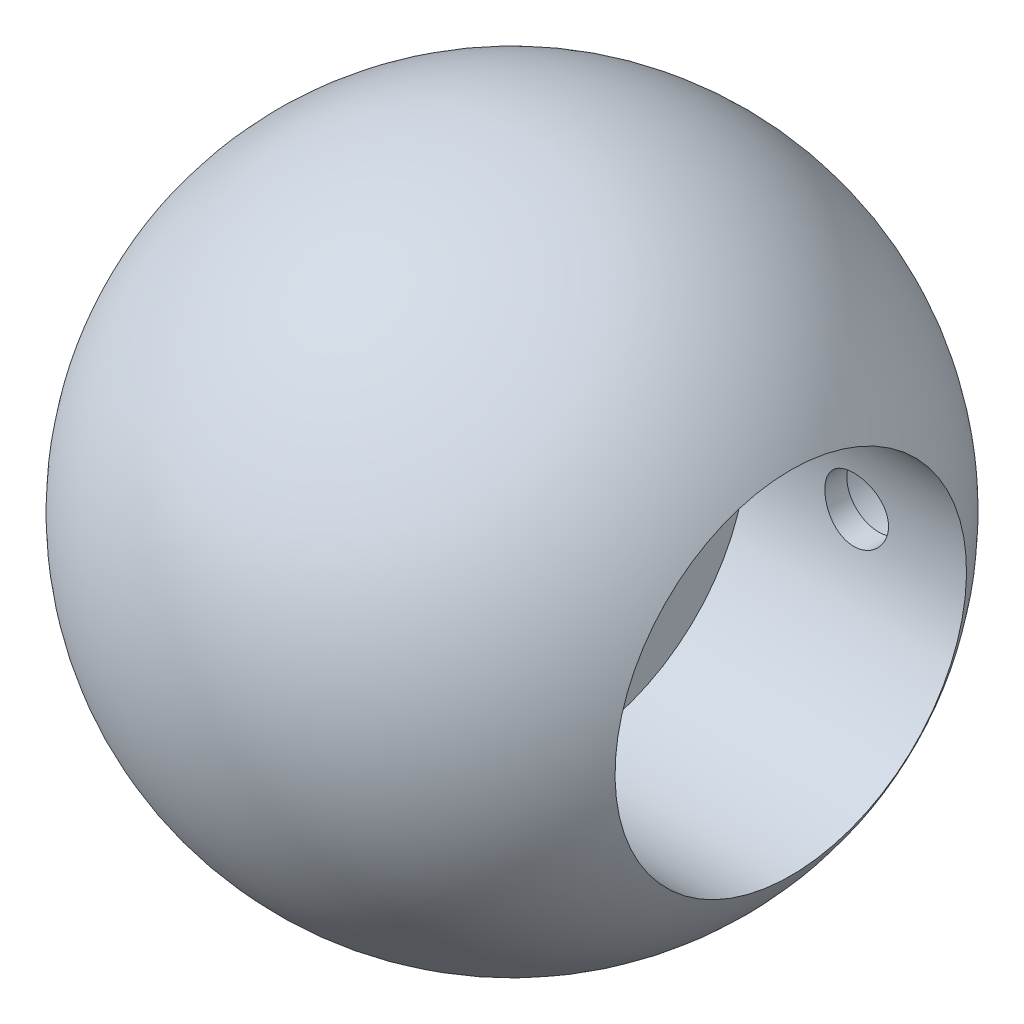
ISO-10303-21;
HEADER;
FILE_DESCRIPTION(('STEP AP214'),'2;1');
FILE_NAME('part.step','',(''),(''),'','','');
FILE_SCHEMA(('AUTOMOTIVE_DESIGN { 1 0 10303 214 1 1 1 1 }'));
ENDSEC;
DATA;
#1=APPLICATION_CONTEXT('core data for automotive mechanical design processes');
#2=APPLICATION_PROTOCOL_DEFINITION('international standard','automotive_design',2000,#1);
#3=PRODUCT_CONTEXT('',#1,'mechanical');
#4=PRODUCT('Part','Part','',(#3));
#5=PRODUCT_RELATED_PRODUCT_CATEGORY('part','',(#4));
#6=PRODUCT_DEFINITION_FORMATION('','',#4);
#7=PRODUCT_DEFINITION_CONTEXT('part definition',#1,'design');
#8=PRODUCT_DEFINITION('design','',#6,#7);
#9=PRODUCT_DEFINITION_SHAPE('','',#8);
#10=(LENGTH_UNIT() NAMED_UNIT(*) SI_UNIT(.MILLI.,.METRE.));
#11=(NAMED_UNIT(*) PLANE_ANGLE_UNIT() SI_UNIT($,.RADIAN.));
#12=(NAMED_UNIT(*) SI_UNIT($,.STERADIAN.) SOLID_ANGLE_UNIT());
#13=UNCERTAINTY_MEASURE_WITH_UNIT(LENGTH_MEASURE(1.E-05),#10,'distance_accuracy_value','');
#14=(GEOMETRIC_REPRESENTATION_CONTEXT(3) GLOBAL_UNCERTAINTY_ASSIGNED_CONTEXT((#13)) GLOBAL_UNIT_ASSIGNED_CONTEXT((#10,
#11,#12)) REPRESENTATION_CONTEXT('',''));
#15=CARTESIAN_POINT('',(0.,0.,0.));
#16=DIRECTION('',(0.,0.,1.));
#17=DIRECTION('',(1.,0.,0.));
#18=AXIS2_PLACEMENT_3D('',#15,#16,#17);
#19=CARTESIAN_POINT('',(2.68857754044952,0.,0.));
#20=DIRECTION('',(1.,0.,0.));
#21=DIRECTION('',(0.,1.,0.));
#22=AXIS2_PLACEMENT_3D('',#19,#20,#21);
#23=CYLINDRICAL_SURFACE('',#22,8.);
#24=CARTESIAN_POINT('',(2.68857754044952,0.,0.));
#25=DIRECTION('',(1.,0.,0.));
#26=DIRECTION('',(0.,1.,0.));
#27=AXIS2_PLACEMENT_3D('',#24,#25,#26);
#28=CIRCLE('',#27,8.);
#29=CARTESIAN_POINT('',(2.68857754044952,8.,0.));
#30=VERTEX_POINT('',#29);
#31=EDGE_CURVE('E10',#30,#30,#28,.T.);
#32=ORIENTED_EDGE('',*,*,#31,.F.);
#33=EDGE_LOOP('',(#32));
#34=FACE_BOUND('',#33,.T.);
#35=CARTESIAN_POINT('',(12.6885775404495,0.,0.));
#36=DIRECTION('',(1.,0.,0.));
#37=DIRECTION('',(0.,1.,0.));
#38=AXIS2_PLACEMENT_3D('',#35,#36,#37);
#39=CIRCLE('',#38,8.);
#40=CARTESIAN_POINT('',(12.6885775404495,8.,0.));
#41=VERTEX_POINT('',#40);
#42=EDGE_CURVE('E50',#41,#41,#39,.T.);
#43=ORIENTED_EDGE('',*,*,#42,.T.);
#44=EDGE_LOOP('',(#43));
#45=FACE_BOUND('',#44,.T.);
#46=CARTESIAN_POINT('',(6.23857754044952,0.,-8.));
#47=CARTESIAN_POINT('',(6.2385806760552,-0.0807384168234218,-7.99999855711492));
#48=CARTESIAN_POINT('',(6.2453438010963,-0.161518203029463,-7.99876509049859));
#49=CARTESIAN_POINT('',(6.27220211897829,-0.320804782772892,-7.9939633998169));
#50=CARTESIAN_POINT('',(6.29230887818976,-0.399309542630493,-7.99039315024603));
#51=CARTESIAN_POINT('',(6.34522131851264,-0.551719111767319,-7.98131760656954));
#52=CARTESIAN_POINT('',(6.37801586589205,-0.625627888274455,-7.97581400939515));
#53=CARTESIAN_POINT('',(6.45534210489281,-0.766886478728498,-7.96347404674392));
#54=CARTESIAN_POINT('',(6.49987272513365,-0.83423689061719,-7.9566378029386));
#55=CARTESIAN_POINT('',(6.59993798264261,-0.961230528069859,-7.94230232780297));
#56=CARTESIAN_POINT('',(6.65557873062222,-1.02078947767733,-7.93479712298762));
#57=CARTESIAN_POINT('',(6.77605649344991,-1.12978079245367,-7.92001437127186));
#58=CARTESIAN_POINT('',(6.8408941424298,-1.17921245876536,-7.91273684011195));
#59=CARTESIAN_POINT('',(6.97851565072859,-1.26689260060321,-7.89917544937293));
#60=CARTESIAN_POINT('',(7.05135448403173,-1.30505608656449,-7.89289929776914));
#61=CARTESIAN_POINT('',(7.20254224729483,-1.36857266110055,-7.88213507076236));
#62=CARTESIAN_POINT('',(7.28089073397106,-1.39392677892338,-7.877646851703));
#63=CARTESIAN_POINT('',(7.43997455469452,-1.43083595475153,-7.87102659917878));
#64=CARTESIAN_POINT('',(7.52067483194885,-1.44253754065479,-7.86886956478164));
#65=CARTESIAN_POINT('',(7.68291991739962,-1.4522641471114,-7.86708046082951));
#66=CARTESIAN_POINT('',(7.76446465430429,-1.45029031293551,-7.86744817983483));
#67=CARTESIAN_POINT('',(7.92502722435841,-1.43284109082218,-7.87064425220334));
#68=CARTESIAN_POINT('',(8.00406378675053,-1.41753168809446,-7.87344235385138));
#69=CARTESIAN_POINT('',(8.15842772248454,-1.37410702319918,-7.88113645094699));
#70=CARTESIAN_POINT('',(8.23375494748332,-1.3459912493418,-7.88603253022063));
#71=CARTESIAN_POINT('',(8.37905110877286,-1.27758777101005,-7.8974028718839));
#72=CARTESIAN_POINT('',(8.44898750223014,-1.23723245261723,-7.90388586131608));
#73=CARTESIAN_POINT('',(8.58115872016692,-1.14554329981403,-7.91769369687743));
#74=CARTESIAN_POINT('',(8.64339281181744,-1.0942084220285,-7.92501862298427));
#75=CARTESIAN_POINT('',(8.75935241474076,-0.981119488893101,-7.93981716356005));
#76=CARTESIAN_POINT('',(8.81293935093176,-0.919223320820417,-7.947291380577));
#77=CARTESIAN_POINT('',(8.90898921520575,-0.787245929686102,-7.961447183467));
#78=CARTESIAN_POINT('',(8.951452045184,-0.717164634446797,-7.96812876234942));
#79=CARTESIAN_POINT('',(9.02406629758833,-0.570666241716288,-7.97995863477376));
#80=CARTESIAN_POINT('',(9.05420398556251,-0.494242189626407,-7.98510521608114));
#81=CARTESIAN_POINT('',(9.10117595484837,-0.337302535747974,-7.99327184080502));
#82=CARTESIAN_POINT('',(9.11801155534458,-0.256787340526246,-7.99629209508878));
#83=CARTESIAN_POINT('',(9.1377101366545,-0.0951438150286457,-7.9998369910284));
#84=CARTESIAN_POINT('',(9.1407630987907,-0.0140393560781258,-8.00039556220426));
#85=CARTESIAN_POINT('',(9.13331837721171,0.147521420048085,-7.99904763243992));
#86=CARTESIAN_POINT('',(9.12282131392907,0.22797776673,-7.997141244366));
#87=CARTESIAN_POINT('',(9.08873249594202,0.385360780150269,-7.99109868648559));
#88=CARTESIAN_POINT('',(9.06523622590725,0.462308807440176,-7.98697878218856));
#89=CARTESIAN_POINT('',(9.00591881521586,0.611173476743285,-7.97696921908575));
#90=CARTESIAN_POINT('',(8.97009688126328,0.683089794550443,-7.97107944637202));
#91=CARTESIAN_POINT('',(8.88671996121872,0.820664915616786,-7.95809888753131));
#92=CARTESIAN_POINT('',(8.83904808061476,0.886251746357814,-7.95099637108971));
#93=CARTESIAN_POINT('',(8.73348348469769,1.0085627806793,-7.93640989650367));
#94=CARTESIAN_POINT('',(8.67558988171202,1.06528621373946,-7.92892590527147));
#95=CARTESIAN_POINT('',(8.55036756546034,1.16897670385417,-7.91430829115978));
#96=CARTESIAN_POINT('',(8.48293107405102,1.21581450012393,-7.90718014246468));
#97=CARTESIAN_POINT('',(8.34103568380943,1.29749725361189,-7.89418891323489));
#98=CARTESIAN_POINT('',(8.26657703508326,1.33234263775492,-7.8883257876687));
#99=CARTESIAN_POINT('',(8.11308944653165,1.38886500670451,-7.87857082899044));
#100=CARTESIAN_POINT('',(8.03408351188765,1.41060282081408,-7.87466990395995));
#101=CARTESIAN_POINT('',(7.87346393009722,1.44048187516075,-7.8692595951911));
#102=CARTESIAN_POINT('',(7.79185055668939,1.44862453791815,-7.86774996124231));
#103=CARTESIAN_POINT('',(7.62962625273182,1.45103699837206,-7.86730526599662));
#104=CARTESIAN_POINT('',(7.54901838474906,1.44551054413902,-7.86833239212087));
#105=CARTESIAN_POINT('',(7.38990057100897,1.42118600391509,-7.8727619445481));
#106=CARTESIAN_POINT('',(7.31139061462356,1.4023879851716,-7.87616435881542));
#107=CARTESIAN_POINT('',(7.15879725189389,1.35213747052833,-7.88494567612137));
#108=CARTESIAN_POINT('',(7.08470684412602,1.32070563533443,-7.89032135095004));
#109=CARTESIAN_POINT('',(6.94281832550962,1.24610154534256,-7.90244600960305));
#110=CARTESIAN_POINT('',(6.87502061896064,1.20292853688572,-7.90919508157791));
#111=CARTESIAN_POINT('',(6.74661862541525,1.10535337918196,-7.92342424931987));
#112=CARTESIAN_POINT('',(6.68612838500231,1.05080242837479,-7.93091325960403));
#113=CARTESIAN_POINT('',(6.57509187779481,0.932331416247753,-7.94571044164199));
#114=CARTESIAN_POINT('',(6.52454790032193,0.868409203847946,-7.95301857142509));
#115=CARTESIAN_POINT('',(6.43444768382675,0.732373457191772,-7.96670175025596));
#116=CARTESIAN_POINT('',(6.39498649329062,0.660196116623782,-7.97306851844025));
#117=CARTESIAN_POINT('',(6.32881238402514,0.51014608807437,-7.98407092348129));
#118=CARTESIAN_POINT('',(6.30208726399341,0.432278933836142,-7.98870821626546));
#119=CARTESIAN_POINT('',(6.26768795438668,0.295132428700154,-7.99476282370485));
#120=CARTESIAN_POINT('',(6.25678983347495,0.23666406321825,-7.99671586095906));
#121=CARTESIAN_POINT('',(6.24223355481907,0.118804585232507,-7.99933496541903));
#122=CARTESIAN_POINT('',(6.23857523303137,0.0594134936670606,-8.00000106178505));
#123=CARTESIAN_POINT('',(6.23857754044952,0.,-8.));
#124=B_SPLINE_CURVE_WITH_KNOTS('',3,(#46,#47,#48,#49,#50,#51,#52,#53,#54,#55,#56,#57,#58,#59,
#60,#61,#62,#63,#64,#65,#66,#67,#68,#69,#70,#71,#72,#73,#74,#75,#76,#77,#78,#79,#80,#81,#82,#83,
#84,#85,#86,#87,#88,#89,#90,#91,#92,#93,#94,#95,#96,#97,#98,#99,#100,#101,#102,#103,#104,#105,
#106,#107,#108,#109,#110,#111,#112,#113,#114,#115,#116,#117,#118,#119,#120,#121,#122,#123),
.UNSPECIFIED.,.T.,.F.,(4,2,2,2,2,2,2,2,2,2,2,2,2,2,2,2,2,2,2,2,2,2,2,2,2,2,2,2,2,2,2,2,2,2,2,2,
2,2,4),(0.,0.241998005083903,0.484206050469161,0.726202034835193,0.968175935150453,
1.21258210508713,1.45700513517391,1.70322719237315,1.94942946218773,2.19296428672087,
2.43647871627249,2.67700479284052,2.91754048068242,3.15942992047401,3.40134235696736,
3.64681209460557,3.89228399699606,4.13802869911066,4.38374902735811,4.62607176898318,
4.86838341545722,5.10893836825512,5.34950880638366,5.59255371621676,5.83561974289255,
6.0816902042224,6.3277519046408,6.57266271856359,6.8175479047878,7.05880495959788,
7.30006079196023,7.54092368157355,7.78180203568168,8.02605402091786,8.27036215980735,
8.51670566292771,8.76281268933125,8.94089733977542,9.11897795502874),.UNSPECIFIED.);
#125=CARTESIAN_POINT('',(6.23857754044952,0.,-8.));
#126=VERTEX_POINT('',#125);
#127=EDGE_CURVE('E60',#126,#126,#124,.T.);
#128=ORIENTED_EDGE('',*,*,#127,.F.);
#129=EDGE_LOOP('',(#128));
#130=FACE_BOUND('',#129,.T.);
#131=CARTESIAN_POINT('',(6.23857754044952,0.,8.));
#132=CARTESIAN_POINT('',(6.2385806760552,0.0807384168234219,7.99999855711492));
#133=CARTESIAN_POINT('',(6.2453438010963,0.161518203029463,7.99876509049859));
#134=CARTESIAN_POINT('',(6.27220211897829,0.320804782772892,7.9939633998169));
#135=CARTESIAN_POINT('',(6.29230887818976,0.399309542630494,7.99039315024603));
#136=CARTESIAN_POINT('',(6.34522131851264,0.551719111767319,7.98131760656954));
#137=CARTESIAN_POINT('',(6.37801586589205,0.625627888274455,7.97581400939515));
#138=CARTESIAN_POINT('',(6.45534210489281,0.766886478728498,7.96347404674392));
#139=CARTESIAN_POINT('',(6.49987272513365,0.83423689061719,7.9566378029386));
#140=CARTESIAN_POINT('',(6.59993798264261,0.961230528069859,7.94230232780297));
#141=CARTESIAN_POINT('',(6.65557873062222,1.02078947767733,7.93479712298762));
#142=CARTESIAN_POINT('',(6.77605649344991,1.12978079245367,7.92001437127186));
#143=CARTESIAN_POINT('',(6.8408941424298,1.17921245876536,7.91273684011195));
#144=CARTESIAN_POINT('',(6.97851565072859,1.26689260060321,7.89917544937293));
#145=CARTESIAN_POINT('',(7.05135448403173,1.30505608656449,7.89289929776914));
#146=CARTESIAN_POINT('',(7.20254224729483,1.36857266110055,7.88213507076236));
#147=CARTESIAN_POINT('',(7.28089073397106,1.39392677892338,7.877646851703));
#148=CARTESIAN_POINT('',(7.43997455469452,1.43083595475153,7.87102659917878));
#149=CARTESIAN_POINT('',(7.52067483194885,1.44253754065479,7.86886956478164));
#150=CARTESIAN_POINT('',(7.68291991739962,1.4522641471114,7.86708046082951));
#151=CARTESIAN_POINT('',(7.76446465430429,1.45029031293551,7.86744817983483));
#152=CARTESIAN_POINT('',(7.92502722435841,1.43284109082218,7.87064425220334));
#153=CARTESIAN_POINT('',(8.00406378675053,1.41753168809446,7.87344235385138));
#154=CARTESIAN_POINT('',(8.15842772248454,1.37410702319918,7.88113645094699));
#155=CARTESIAN_POINT('',(8.23375494748332,1.3459912493418,7.88603253022062));
#156=CARTESIAN_POINT('',(8.37905110877286,1.27758777101005,7.8974028718839));
#157=CARTESIAN_POINT('',(8.44898750223014,1.23723245261723,7.90388586131608));
#158=CARTESIAN_POINT('',(8.58115872016692,1.14554329981403,7.91769369687743));
#159=CARTESIAN_POINT('',(8.64339281181744,1.0942084220285,7.92501862298426));
#160=CARTESIAN_POINT('',(8.75935241474076,0.981119488893101,7.93981716356005));
#161=CARTESIAN_POINT('',(8.81293935093176,0.919223320820418,7.947291380577));
#162=CARTESIAN_POINT('',(8.90898921520575,0.787245929686103,7.961447183467));
#163=CARTESIAN_POINT('',(8.951452045184,0.717164634446797,7.96812876234941));
#164=CARTESIAN_POINT('',(9.02406629758833,0.570666241716289,7.97995863477376));
#165=CARTESIAN_POINT('',(9.05420398556251,0.494242189626407,7.98510521608114));
#166=CARTESIAN_POINT('',(9.10117595484837,0.337302535747974,7.99327184080502));
#167=CARTESIAN_POINT('',(9.11801155534458,0.256787340526246,7.99629209508878));
#168=CARTESIAN_POINT('',(9.1377101366545,0.0951438150286459,7.9998369910284));
#169=CARTESIAN_POINT('',(9.1407630987907,0.0140393560781263,8.00039556220426));
#170=CARTESIAN_POINT('',(9.13331837721171,-0.147521420048084,7.99904763243992));
#171=CARTESIAN_POINT('',(9.12282131392907,-0.227977766729999,7.997141244366));
#172=CARTESIAN_POINT('',(9.08873249594202,-0.385360780150268,7.99109868648559));
#173=CARTESIAN_POINT('',(9.06523622590725,-0.462308807440174,7.98697878218856));
#174=CARTESIAN_POINT('',(9.00591881521586,-0.611173476743283,7.97696921908575));
#175=CARTESIAN_POINT('',(8.97009688126328,-0.683089794550442,7.97107944637202));
#176=CARTESIAN_POINT('',(8.88671996121872,-0.820664915616785,7.95809888753131));
#177=CARTESIAN_POINT('',(8.83904808061476,-0.886251746357813,7.95099637108971));
#178=CARTESIAN_POINT('',(8.73348348469769,-1.0085627806793,7.93640989650367));
#179=CARTESIAN_POINT('',(8.67558988171202,-1.06528621373946,7.92892590527147));
#180=CARTESIAN_POINT('',(8.55036756546034,-1.16897670385416,7.91430829115978));
#181=CARTESIAN_POINT('',(8.48293107405103,-1.21581450012393,7.90718014246468));
#182=CARTESIAN_POINT('',(8.34103568380944,-1.29749725361189,7.89418891323489));
#183=CARTESIAN_POINT('',(8.26657703508327,-1.33234263775492,7.88832578766869));
#184=CARTESIAN_POINT('',(8.11308944653165,-1.38886500670451,7.87857082899044));
#185=CARTESIAN_POINT('',(8.03408351188765,-1.41060282081408,7.87466990395996));
#186=CARTESIAN_POINT('',(7.87346393009722,-1.44048187516075,7.8692595951911));
#187=CARTESIAN_POINT('',(7.79185055668939,-1.44862453791815,7.86774996124231));
#188=CARTESIAN_POINT('',(7.62962625273182,-1.45103699837206,7.86730526599662));
#189=CARTESIAN_POINT('',(7.54901838474906,-1.44551054413902,7.86833239212087));
#190=CARTESIAN_POINT('',(7.38990057100897,-1.42118600391509,7.8727619445481));
#191=CARTESIAN_POINT('',(7.31139061462356,-1.4023879851716,7.87616435881542));
#192=CARTESIAN_POINT('',(7.15879725189389,-1.35213747052833,7.88494567612137));
#193=CARTESIAN_POINT('',(7.08470684412602,-1.32070563533443,7.89032135095004));
#194=CARTESIAN_POINT('',(6.94281832550962,-1.24610154534256,7.90244600960305));
#195=CARTESIAN_POINT('',(6.87502061896064,-1.20292853688572,7.90919508157791));
#196=CARTESIAN_POINT('',(6.74661862541525,-1.10535337918196,7.92342424931987));
#197=CARTESIAN_POINT('',(6.68612838500231,-1.05080242837479,7.93091325960403));
#198=CARTESIAN_POINT('',(6.57509187779481,-0.932331416247753,7.94571044164199));
#199=CARTESIAN_POINT('',(6.52454790032193,-0.868409203847946,7.95301857142509));
#200=CARTESIAN_POINT('',(6.43444768382675,-0.732373457191773,7.96670175025596));
#201=CARTESIAN_POINT('',(6.39498649329062,-0.660196116623782,7.97306851844025));
#202=CARTESIAN_POINT('',(6.32881238402514,-0.51014608807437,7.98407092348129));
#203=CARTESIAN_POINT('',(6.30208726399341,-0.432278933836143,7.98870821626546));
#204=CARTESIAN_POINT('',(6.26768795438668,-0.295132428700155,7.99476282370485));
#205=CARTESIAN_POINT('',(6.25678983347495,-0.23666406321825,7.99671586095906));
#206=CARTESIAN_POINT('',(6.24223355481907,-0.118804585232507,7.99933496541903));
#207=CARTESIAN_POINT('',(6.23857523303137,-0.0594134936670606,8.00000106178504));
#208=CARTESIAN_POINT('',(6.23857754044952,0.,8.));
#209=B_SPLINE_CURVE_WITH_KNOTS('',3,(#131,#132,#133,#134,#135,#136,#137,#138,#139,#140,#141,
#142,#143,#144,#145,#146,#147,#148,#149,#150,#151,#152,#153,#154,#155,#156,#157,#158,#159,#160,
#161,#162,#163,#164,#165,#166,#167,#168,#169,#170,#171,#172,#173,#174,#175,#176,#177,#178,#179,
#180,#181,#182,#183,#184,#185,#186,#187,#188,#189,#190,#191,#192,#193,#194,#195,#196,#197,#198,
#199,#200,#201,#202,#203,#204,#205,#206,#207,#208),.UNSPECIFIED.,.T.,.F.,(4,2,2,2,2,2,2,2,2,2,2,
2,2,2,2,2,2,2,2,2,2,2,2,2,2,2,2,2,2,2,2,2,2,2,2,2,2,2,4),(0.,0.241998005083904,
0.484206050469161,0.726202034835193,0.968175935150453,1.21258210508713,1.45700513517391,
1.70322719237315,1.94942946218773,2.19296428672087,2.43647871627249,2.67700479284052,
2.91754048068242,3.15942992047401,3.40134235696736,3.64681209460557,3.89228399699606,
4.13802869911066,4.38374902735812,4.62607176898318,4.86838341545722,5.10893836825512,
5.34950880638366,5.59255371621676,5.83561974289254,6.0816902042224,6.3277519046408,
6.57266271856359,6.8175479047878,7.05880495959788,7.30006079196023,7.54092368157355,
7.78180203568168,8.02605402091786,8.27036215980735,8.51670566292771,8.76281268933125,
8.94089733977542,9.11897795502874),.UNSPECIFIED.);
#210=CARTESIAN_POINT('',(6.23857754044952,0.,8.));
#211=VERTEX_POINT('',#210);
#212=EDGE_CURVE('E41',#211,#211,#209,.T.);
#213=ORIENTED_EDGE('',*,*,#212,.F.);
#214=EDGE_LOOP('',(#213));
#215=FACE_BOUND('',#214,.T.);
#216=ADVANCED_FACE('F37',(#34,#45,#130,#215),#23,.F.);
#217=CARTESIAN_POINT('',(0.,0.,0.));
#218=DIRECTION('',(1.,0.,0.));
#219=DIRECTION('',(0.,1.,0.));
#220=AXIS2_PLACEMENT_3D('',#217,#218,#219);
#221=SPHERICAL_SURFACE('',#220,15.);
#222=CARTESIAN_POINT('',(5.7554001804783,-1.66292672565411,-13.7517287446944));
#223=CARTESIAN_POINT('',(5.85597040156539,-1.77982851218323,-13.69549955601));
#224=CARTESIAN_POINT('',(5.96594759001413,-1.88615774931675,-13.6336642892089));
#225=CARTESIAN_POINT('',(6.19979581173382,-2.07576545040009,-13.5011445821784));
#226=CARTESIAN_POINT('',(6.32369916984898,-2.15898866182964,-13.4304395076688));
#227=CARTESIAN_POINT('',(6.58013802978415,-2.30113459623749,-13.2828210027381));
#228=CARTESIAN_POINT('',(6.71262109854603,-2.36019127571427,-13.2059447013427));
#229=CARTESIAN_POINT('',(6.98298907175049,-2.45461990482593,-13.0475856407814));
#230=CARTESIAN_POINT('',(7.12087206386802,-2.49000016034742,-12.9661045079184));
#231=CARTESIAN_POINT('',(7.41426257524535,-2.54003400397789,-12.7910098627009));
#232=CARTESIAN_POINT('',(7.57003156807434,-2.55195985787169,-12.6970517488183));
#233=CARTESIAN_POINT('',(7.88036412620337,-2.54751421692215,-12.5077223448915));
#234=CARTESIAN_POINT('',(8.03492691119143,-2.53112571947862,-12.4123502398526));
#235=CARTESIAN_POINT('',(8.3506247540197,-2.46820158596749,-12.2152888924182));
#236=CARTESIAN_POINT('',(8.5113727225789,-2.41947955189239,-12.113667435898));
#237=CARTESIAN_POINT('',(8.8225388500805,-2.29020239432537,-11.9145327787832));
#238=CARTESIAN_POINT('',(8.97295039968746,-2.20962712144216,-11.8170222219093));
#239=CARTESIAN_POINT('',(9.25503603634732,-2.01917567196227,-11.6320236816857));
#240=CARTESIAN_POINT('',(9.38703982257336,-1.9099570628173,-11.5443670135127));
#241=CARTESIAN_POINT('',(9.62979612964305,-1.66253839914932,-11.3815403273166));
#242=CARTESIAN_POINT('',(9.74060003001782,-1.52441015701533,-11.3063401809659));
#243=CARTESIAN_POINT('',(9.90354894350358,-1.26949189365885,-11.1948830750827));
#244=CARTESIAN_POINT('',(9.9631974874741,-1.1595635220254,-11.1538052093547));
#245=CARTESIAN_POINT('',(10.0665875648851,-0.929224263702139,-11.0823067801329));
#246=CARTESIAN_POINT('',(10.1103418002217,-0.80882184312782,-11.0518777073991));
#247=CARTESIAN_POINT('',(10.1797700505006,-0.559701525903364,-11.003473241172));
#248=CARTESIAN_POINT('',(10.2053416160749,-0.430940902947346,-10.9855684240347));
#249=CARTESIAN_POINT('',(10.2363035131232,-0.169842394788028,-10.9638781260472));
#250=CARTESIAN_POINT('',(10.2417018937085,-0.0375059575699822,-10.9600870138236));
#251=CARTESIAN_POINT('',(10.2324277913252,0.213570151339251,-10.9665900173979));
#252=CARTESIAN_POINT('',(10.219595174523,0.33241805805152,-10.9755929848885));
#253=CARTESIAN_POINT('',(10.1778390350522,0.565800996824181,-11.0048046514832));
#254=CARTESIAN_POINT('',(10.1489152206653,0.680335950654617,-11.0250135537402));
#255=CARTESIAN_POINT('',(10.0761675364291,0.903203858316632,-11.0756296529055));
#256=CARTESIAN_POINT('',(10.032224574121,1.01147889392295,-11.1061183350848));
#257=CARTESIAN_POINT('',(9.93140970715282,1.21881448468486,-11.1756925820243));
#258=CARTESIAN_POINT('',(9.87453343370159,1.31787191021947,-11.2147810515934));
#259=CARTESIAN_POINT('',(9.74228620940079,1.51681133114971,-11.3051027695533));
#260=CARTESIAN_POINT('',(9.66551140195189,1.61534900558418,-11.357232518301));
#261=CARTESIAN_POINT('',(9.50077371797771,1.79822589057207,-11.4682142716214));
#262=CARTESIAN_POINT('',(9.41280451743716,1.8825570123918,-11.5270700739926));
#263=CARTESIAN_POINT('',(9.21212839806076,2.04966355412584,-11.6602117862898));
#264=CARTESIAN_POINT('',(9.09776220174008,2.12971520979512,-11.7354165042763));
#265=CARTESIAN_POINT('',(8.85987335540281,2.26927564495422,-11.890251839872));
#266=CARTESIAN_POINT('',(8.73634520196833,2.32877195383057,-11.9698851103272));
#267=CARTESIAN_POINT('',(8.46334236159589,2.43450490841772,-12.1440635696607));
#268=CARTESIAN_POINT('',(8.31279405889777,2.47730808123536,-12.2390225330911));
#269=CARTESIAN_POINT('',(8.00686060128817,2.53484660144299,-12.4297264674952));
#270=CARTESIAN_POINT('',(7.85147297905648,2.54956738484237,-12.5254718204682));
#271=CARTESIAN_POINT('',(7.52790271281942,2.55044536354432,-12.7225945835132));
#272=CARTESIAN_POINT('',(7.35963523660358,2.53437532432545,-12.8238552167408));
#273=CARTESIAN_POINT('',(7.02693439084797,2.46849789603891,-13.0217996192367));
#274=CARTESIAN_POINT('',(6.86250138535899,2.41868731697134,-13.1184829548194));
#275=CARTESIAN_POINT('',(6.54845152139334,2.28706240151698,-13.3012502299397));
#276=CARTESIAN_POINT('',(6.39852919102583,2.20632102069772,-13.387574073902));
#277=CARTESIAN_POINT('',(6.11417053614131,2.01326374335331,-13.5498988963983));
#278=CARTESIAN_POINT('',(5.97972151988507,1.90097398784867,-13.6259083444507));
#279=CARTESIAN_POINT('',(5.7480561678035,1.66167919217037,-13.7559697559418));
#280=CARTESIAN_POINT('',(5.64831664342079,1.53798768479396,-13.8115556644383));
#281=CARTESIAN_POINT('',(5.51607379756645,1.33759390199505,-13.8849127834674));
#282=CARTESIAN_POINT('',(5.47488506923889,1.26831472717765,-13.9076960613212));
#283=CARTESIAN_POINT('',(5.39888055160587,1.12531919869199,-13.9496501485188));
#284=CARTESIAN_POINT('',(5.36406365203679,1.05160362102809,-13.9688215872272));
#285=CARTESIAN_POINT('',(5.27907575071653,0.846409864747839,-14.0155427505659));
#286=CARTESIAN_POINT('',(5.23562492700815,0.711177253829918,-14.0393378187373));
#287=CARTESIAN_POINT('',(5.17174657598526,0.433921516980638,-14.0742775161659));
#288=CARTESIAN_POINT('',(5.15130117796823,0.291903751312312,-14.085431964753));
#289=CARTESIAN_POINT('',(5.13539308888272,0.0201951458662447,-14.0941122757992));
#290=CARTESIAN_POINT('',(5.13766207663572,-0.109327592082597,-14.0928755442968));
#291=CARTESIAN_POINT('',(5.16169251940188,-0.366006223115978,-14.0797592759346));
#292=CARTESIAN_POINT('',(5.1834540984844,-0.493162101130316,-14.0678796713336));
#293=CARTESIAN_POINT('',(5.24478582638907,-0.739008497426418,-14.0343190605336));
#294=CARTESIAN_POINT('',(5.28399940665188,-0.857815931734728,-14.0128342636967));
#295=CARTESIAN_POINT('',(5.37840694977189,-1.08670058532412,-13.9609382068158));
#296=CARTESIAN_POINT('',(5.43358859543652,-1.19678445059419,-13.9305338267697));
#297=CARTESIAN_POINT('',(5.53403013975252,-1.36605106967595,-13.8749606735408));
#298=CARTESIAN_POINT('',(5.57503871635301,-1.42862538758247,-13.8522225449737));
#299=CARTESIAN_POINT('',(5.66178823436935,-1.54924011883887,-13.8039890019454));
#300=CARTESIAN_POINT('',(5.70752849951979,-1.60728117801874,-13.7784939814828));
#301=CARTESIAN_POINT('',(5.7554001804783,-1.66292672565411,-13.7517287446944));
#302=B_SPLINE_CURVE_WITH_KNOTS('',3,(#222,#223,#224,#225,#226,#227,#228,#229,#230,#231,#232,
#233,#234,#235,#236,#237,#238,#239,#240,#241,#242,#243,#244,#245,#246,#247,#248,#249,#250,#251,
#252,#253,#254,#255,#256,#257,#258,#259,#260,#261,#262,#263,#264,#265,#266,#267,#268,#269,#270,
#271,#272,#273,#274,#275,#276,#277,#278,#279,#280,#281,#282,#283,#284,#285,#286,#287,#288,#289,
#290,#291,#292,#293,#294,#295,#296,#297,#298,#299,#300,#301),.UNSPECIFIED.,.T.,.F.,(4,2,2,2,2,2,
2,2,2,2,2,2,2,2,2,2,2,2,2,2,2,2,2,2,2,2,2,2,2,2,2,2,2,2,2,2,2,2,2,4),(0.,0.492105942669511,
0.985378697615923,1.47587891537923,1.96620697125315,2.51080962402782,3.05573942114458,
3.64188443374028,4.22840081868832,4.80247992733143,5.37514958079556,5.76850131464617,
6.16153800731215,6.55677206504755,6.95184840733908,7.30976880863786,7.66769569890699,
8.02852923041691,8.38948483076492,8.79401917442313,9.19878307353399,9.6726524986912,
10.1468089103903,10.6936918815352,11.2408583981912,11.8291008282216,12.4173988814061,
12.9869076876125,13.5559459828673,14.05765006964,14.3085358695933,14.5593779120711,
14.9888347359052,15.4179577252334,15.8046914309753,16.1914275982752,16.5706011316736,
16.9494829603306,17.1837600776887,17.4180037576828),.UNSPECIFIED.);
#303=CARTESIAN_POINT('',(5.7554001804783,-1.66292672565411,-13.7517287446944));
#304=VERTEX_POINT('',#303);
#305=EDGE_CURVE('E107',#304,#304,#302,.T.);
#306=ORIENTED_EDGE('',*,*,#305,.T.);
#307=EDGE_LOOP('',(#306));
#308=FACE_BOUND('',#307,.T.);
#309=ORIENTED_EDGE('',*,*,#42,.F.);
#310=EDGE_LOOP('',(#309));
#311=FACE_BOUND('',#310,.T.);
#312=ADVANCED_FACE('F39',(#308,#311),#221,.T.);
#313=CARTESIAN_POINT('',(2.68857754044952,0.,0.));
#314=DIRECTION('',(1.,0.,0.));
#315=DIRECTION('',(0.,1.,0.));
#316=AXIS2_PLACEMENT_3D('',#313,#314,#315);
#317=PLANE('',#316);
#318=ORIENTED_EDGE('',*,*,#31,.T.);
#319=EDGE_LOOP('',(#318));
#320=FACE_BOUND('',#319,.T.);
#321=ADVANCED_FACE('F76',(#320),#317,.T.);
#322=CARTESIAN_POINT('',(7.68857754044952,0.,11.));
#323=DIRECTION('',(0.,0.,-1.));
#324=DIRECTION('',(-1.,0.,0.));
#325=AXIS2_PLACEMENT_3D('',#322,#323,#324);
#326=CYLINDRICAL_SURFACE('',#325,1.45);
#327=CARTESIAN_POINT('',(7.68857754044952,0.,-9.));
#328=DIRECTION('',(0.,0.,1.));
#329=DIRECTION('',(1.,0.,0.));
#330=AXIS2_PLACEMENT_3D('',#327,#328,#329);
#331=CIRCLE('',#330,1.45);
#332=CARTESIAN_POINT('',(9.13857754044952,0.,-9.));
#333=VERTEX_POINT('',#332);
#334=EDGE_CURVE('E101',#333,#333,#331,.T.);
#335=ORIENTED_EDGE('',*,*,#334,.F.);
#336=EDGE_LOOP('',(#335));
#337=FACE_BOUND('',#336,.T.);
#338=ORIENTED_EDGE('',*,*,#127,.T.);
#339=EDGE_LOOP('',(#338));
#340=FACE_BOUND('',#339,.T.);
#341=ADVANCED_FACE('F73',(#337,#340),#326,.F.);
#342=CARTESIAN_POINT('',(7.68857754044952,0.,11.));
#343=DIRECTION('',(0.,0.,1.));
#344=DIRECTION('',(1.,0.,0.));
#345=AXIS2_PLACEMENT_3D('',#342,#343,#344);
#346=CIRCLE('',#345,1.45);
#347=CARTESIAN_POINT('',(9.13857754044952,0.,11.));
#348=VERTEX_POINT('',#347);
#349=EDGE_CURVE('E58',#348,#348,#346,.T.);
#350=ORIENTED_EDGE('',*,*,#349,.T.);
#351=EDGE_LOOP('',(#350));
#352=FACE_BOUND('',#351,.T.);
#353=ORIENTED_EDGE('',*,*,#212,.T.);
#354=EDGE_LOOP('',(#353));
#355=FACE_BOUND('',#354,.T.);
#356=ADVANCED_FACE('F68',(#352,#355),#326,.F.);
#357=CARTESIAN_POINT('',(7.68857754044952,0.,11.));
#358=DIRECTION('',(0.,0.,1.));
#359=DIRECTION('',(1.,0.,0.));
#360=AXIS2_PLACEMENT_3D('',#357,#358,#359);
#361=PLANE('',#360);
#362=ORIENTED_EDGE('',*,*,#349,.F.);
#363=EDGE_LOOP('',(#362));
#364=FACE_BOUND('',#363,.T.);
#365=ADVANCED_FACE('F72',(#364),#361,.F.);
#366=CARTESIAN_POINT('',(7.68857754044952,0.,-15.001));
#367=DIRECTION('',(0.,0.,1.));
#368=DIRECTION('',(1.,0.,0.));
#369=AXIS2_PLACEMENT_3D('',#366,#367,#368);
#370=CYLINDRICAL_SURFACE('',#369,2.55);
#371=ORIENTED_EDGE('',*,*,#305,.F.);
#372=EDGE_LOOP('',(#371));
#373=FACE_BOUND('',#372,.T.);
#374=CARTESIAN_POINT('',(7.68857754044952,0.,-9.));
#375=DIRECTION('',(0.,0.,1.));
#376=DIRECTION('',(1.,0.,0.));
#377=AXIS2_PLACEMENT_3D('',#374,#375,#376);
#378=CIRCLE('',#377,2.55);
#379=CARTESIAN_POINT('',(10.2385775404495,0.,-9.));
#380=VERTEX_POINT('',#379);
#381=EDGE_CURVE('E104',#380,#380,#378,.T.);
#382=ORIENTED_EDGE('',*,*,#381,.T.);
#383=EDGE_LOOP('',(#382));
#384=FACE_BOUND('',#383,.T.);
#385=ADVANCED_FACE('F116',(#373,#384),#370,.F.);
#386=CARTESIAN_POINT('',(7.68857754044952,0.,-9.));
#387=DIRECTION('',(0.,0.,1.));
#388=DIRECTION('',(1.,0.,0.));
#389=AXIS2_PLACEMENT_3D('',#386,#387,#388);
#390=PLANE('',#389);
#391=ORIENTED_EDGE('',*,*,#334,.T.);
#392=EDGE_LOOP('',(#391));
#393=FACE_BOUND('',#392,.T.);
#394=ORIENTED_EDGE('',*,*,#381,.F.);
#395=EDGE_LOOP('',(#394));
#396=FACE_BOUND('',#395,.T.);
#397=ADVANCED_FACE('F120',(#393,#396),#390,.F.);
#398=CLOSED_SHELL('',(#216,#312,#321,#341,#356,#365,#385,#397));
#399=MANIFOLD_SOLID_BREP('B2',#398);
#400=ADVANCED_BREP_SHAPE_REPRESENTATION('',(#18,#399),#14);
#401=SHAPE_DEFINITION_REPRESENTATION(#9,#400);
ENDSEC;
END-ISO-10303-21;
